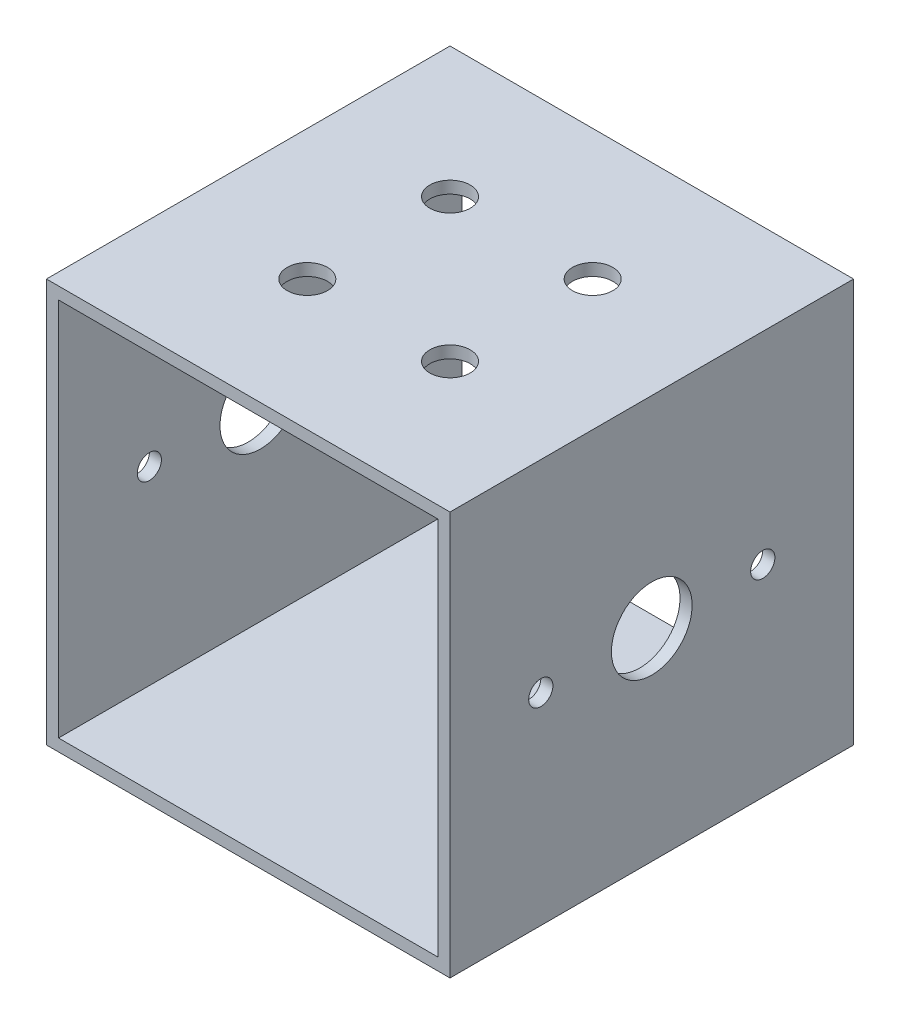
ISO-10303-21;
HEADER;
FILE_DESCRIPTION(('STEP AP214'),'2;1');
FILE_NAME('part.step','',(''),(''),'','','');
FILE_SCHEMA(('AUTOMOTIVE_DESIGN { 1 0 10303 214 1 1 1 1 }'));
ENDSEC;
DATA;
#1=APPLICATION_CONTEXT('core data for automotive mechanical design processes');
#2=APPLICATION_PROTOCOL_DEFINITION('international standard','automotive_design',2000,#1);
#3=PRODUCT_CONTEXT('',#1,'mechanical');
#4=PRODUCT('Part','Part','',(#3));
#5=PRODUCT_RELATED_PRODUCT_CATEGORY('part','',(#4));
#6=PRODUCT_DEFINITION_FORMATION('','',#4);
#7=PRODUCT_DEFINITION_CONTEXT('part definition',#1,'design');
#8=PRODUCT_DEFINITION('design','',#6,#7);
#9=PRODUCT_DEFINITION_SHAPE('','',#8);
#10=(LENGTH_UNIT() NAMED_UNIT(*) SI_UNIT(.MILLI.,.METRE.));
#11=(NAMED_UNIT(*) PLANE_ANGLE_UNIT() SI_UNIT($,.RADIAN.));
#12=(NAMED_UNIT(*) SI_UNIT($,.STERADIAN.) SOLID_ANGLE_UNIT());
#13=UNCERTAINTY_MEASURE_WITH_UNIT(LENGTH_MEASURE(1.E-05),#10,'distance_accuracy_value','');
#14=(GEOMETRIC_REPRESENTATION_CONTEXT(3) GLOBAL_UNCERTAINTY_ASSIGNED_CONTEXT((#13)) GLOBAL_UNIT_ASSIGNED_CONTEXT((#10,
#11,#12)) REPRESENTATION_CONTEXT('',''));
#15=CARTESIAN_POINT('',(0.,0.,0.));
#16=DIRECTION('',(0.,0.,1.));
#17=DIRECTION('',(1.,0.,0.));
#18=AXIS2_PLACEMENT_3D('',#15,#16,#17);
#19=CARTESIAN_POINT('',(25.,25.,50.));
#20=DIRECTION('',(0.,-1.,0.));
#21=DIRECTION('',(1.,0.,0.));
#22=AXIS2_PLACEMENT_3D('',#19,#20,#21);
#23=PLANE('',#22);
#24=CARTESIAN_POINT('',(-8.83883476483184,25.,33.8388347648319));
#25=DIRECTION('',(0.,1.,0.));
#26=DIRECTION('',(-1.,0.,0.));
#27=AXIS2_PLACEMENT_3D('',#24,#25,#26);
#28=CIRCLE('',#27,2.5);
#29=CARTESIAN_POINT('',(-11.3388347648318,25.,33.8388347648319));
#30=VERTEX_POINT('',#29);
#31=EDGE_CURVE('E252',#30,#30,#28,.T.);
#32=ORIENTED_EDGE('',*,*,#31,.F.);
#33=EDGE_LOOP('',(#32));
#34=FACE_BOUND('',#33,.T.);
#35=CARTESIAN_POINT('',(8.83883476483182,25.,33.8388347648319));
#36=DIRECTION('',(0.,1.,0.));
#37=DIRECTION('',(-1.,0.,0.));
#38=AXIS2_PLACEMENT_3D('',#35,#36,#37);
#39=CIRCLE('',#38,2.5);
#40=CARTESIAN_POINT('',(6.33883476483182,25.,33.8388347648319));
#41=VERTEX_POINT('',#40);
#42=EDGE_CURVE('E248',#41,#41,#39,.F.);
#43=ORIENTED_EDGE('',*,*,#42,.T.);
#44=EDGE_LOOP('',(#43));
#45=FACE_BOUND('',#44,.T.);
#46=CARTESIAN_POINT('',(-8.83883476483184,25.,16.1611652351681));
#47=DIRECTION('',(0.,1.,0.));
#48=DIRECTION('',(-1.,0.,0.));
#49=AXIS2_PLACEMENT_3D('',#46,#47,#48);
#50=CIRCLE('',#49,2.5);
#51=CARTESIAN_POINT('',(-11.3388347648318,25.,16.1611652351681));
#52=VERTEX_POINT('',#51);
#53=EDGE_CURVE('E205',#52,#52,#50,.F.);
#54=ORIENTED_EDGE('',*,*,#53,.T.);
#55=EDGE_LOOP('',(#54));
#56=FACE_BOUND('',#55,.T.);
#57=DIRECTION('',(-1.,0.,0.));
#58=VECTOR('',#57,1.);
#59=CARTESIAN_POINT('',(25.,25.,0.));
#60=LINE('',#59,#58);
#61=CARTESIAN_POINT('',(25.,25.,0.));
#62=VERTEX_POINT('',#61);
#63=CARTESIAN_POINT('',(-25.,25.,0.));
#64=VERTEX_POINT('',#63);
#65=EDGE_CURVE('E179',#62,#64,#60,.T.);
#66=ORIENTED_EDGE('',*,*,#65,.T.);
#67=DIRECTION('',(0.,0.,-1.));
#68=VECTOR('',#67,1.);
#69=CARTESIAN_POINT('',(-25.,25.,50.));
#70=LINE('',#69,#68);
#71=CARTESIAN_POINT('',(-25.,25.,50.));
#72=VERTEX_POINT('',#71);
#73=EDGE_CURVE('E187',#72,#64,#70,.T.);
#74=ORIENTED_EDGE('',*,*,#73,.F.);
#75=DIRECTION('',(-1.,0.,0.));
#76=VECTOR('',#75,1.);
#77=CARTESIAN_POINT('',(25.,25.,50.));
#78=LINE('',#77,#76);
#79=CARTESIAN_POINT('',(25.,25.,50.));
#80=VERTEX_POINT('',#79);
#81=EDGE_CURVE('E166',#80,#72,#78,.T.);
#82=ORIENTED_EDGE('',*,*,#81,.F.);
#83=DIRECTION('',(0.,0.,-1.));
#84=VECTOR('',#83,1.);
#85=CARTESIAN_POINT('',(25.,25.,50.));
#86=LINE('',#85,#84);
#87=EDGE_CURVE('E49',#80,#62,#86,.T.);
#88=ORIENTED_EDGE('',*,*,#87,.T.);
#89=EDGE_LOOP('',(#66,#74,#82,#88));
#90=FACE_BOUND('',#89,.T.);
#91=CARTESIAN_POINT('',(8.83883476483182,25.,16.1611652351681));
#92=DIRECTION('',(0.,1.,0.));
#93=DIRECTION('',(-1.,0.,0.));
#94=AXIS2_PLACEMENT_3D('',#91,#92,#93);
#95=CIRCLE('',#94,2.5);
#96=CARTESIAN_POINT('',(6.33883476483182,25.,16.1611652351681));
#97=VERTEX_POINT('',#96);
#98=EDGE_CURVE('E253',#97,#97,#95,.T.);
#99=ORIENTED_EDGE('',*,*,#98,.F.);
#100=EDGE_LOOP('',(#99));
#101=FACE_BOUND('',#100,.T.);
#102=ADVANCED_FACE('F39',(#34,#45,#56,#90,#101),#23,.F.);
#103=CARTESIAN_POINT('',(23.5,23.5,50.));
#104=DIRECTION('',(0.,-1.,0.));
#105=DIRECTION('',(1.,0.,0.));
#106=AXIS2_PLACEMENT_3D('',#103,#104,#105);
#107=PLANE('',#106);
#108=CARTESIAN_POINT('',(8.83883476483182,23.5,33.8388347648319));
#109=DIRECTION('',(0.,-1.,0.));
#110=DIRECTION('',(1.,0.,0.));
#111=AXIS2_PLACEMENT_3D('',#108,#109,#110);
#112=CIRCLE('',#111,2.5);
#113=CARTESIAN_POINT('',(11.3388347648318,23.5,33.8388347648319));
#114=VERTEX_POINT('',#113);
#115=EDGE_CURVE('E204',#114,#114,#112,.F.);
#116=ORIENTED_EDGE('',*,*,#115,.T.);
#117=EDGE_LOOP('',(#116));
#118=FACE_BOUND('',#117,.T.);
#119=CARTESIAN_POINT('',(-8.83883476483184,23.5,16.1611652351681));
#120=DIRECTION('',(0.,-1.,0.));
#121=DIRECTION('',(1.,0.,0.));
#122=AXIS2_PLACEMENT_3D('',#119,#120,#121);
#123=CIRCLE('',#122,2.5);
#124=CARTESIAN_POINT('',(-6.33883476483184,23.5,16.1611652351681));
#125=VERTEX_POINT('',#124);
#126=EDGE_CURVE('E200',#125,#125,#123,.F.);
#127=ORIENTED_EDGE('',*,*,#126,.T.);
#128=EDGE_LOOP('',(#127));
#129=FACE_BOUND('',#128,.T.);
#130=DIRECTION('',(-1.,0.,0.));
#131=VECTOR('',#130,1.);
#132=CARTESIAN_POINT('',(23.5,23.5,0.));
#133=LINE('',#132,#131);
#134=CARTESIAN_POINT('',(23.5,23.5,0.));
#135=VERTEX_POINT('',#134);
#136=CARTESIAN_POINT('',(-23.5,23.5,0.));
#137=VERTEX_POINT('',#136);
#138=EDGE_CURVE('E117',#135,#137,#133,.T.);
#139=ORIENTED_EDGE('',*,*,#138,.F.);
#140=DIRECTION('',(0.,0.,-1.));
#141=VECTOR('',#140,1.);
#142=CARTESIAN_POINT('',(23.5,23.5,50.));
#143=LINE('',#142,#141);
#144=CARTESIAN_POINT('',(23.5,23.5,50.));
#145=VERTEX_POINT('',#144);
#146=EDGE_CURVE('E57',#145,#135,#143,.T.);
#147=ORIENTED_EDGE('',*,*,#146,.F.);
#148=DIRECTION('',(-1.,0.,0.));
#149=VECTOR('',#148,1.);
#150=CARTESIAN_POINT('',(23.5,23.5,50.));
#151=LINE('',#150,#149);
#152=CARTESIAN_POINT('',(-23.5,23.5,50.));
#153=VERTEX_POINT('',#152);
#154=EDGE_CURVE('E134',#145,#153,#151,.T.);
#155=ORIENTED_EDGE('',*,*,#154,.T.);
#156=DIRECTION('',(0.,0.,-1.));
#157=VECTOR('',#156,1.);
#158=CARTESIAN_POINT('',(-23.5,23.5,50.));
#159=LINE('',#158,#157);
#160=EDGE_CURVE('E111',#153,#137,#159,.T.);
#161=ORIENTED_EDGE('',*,*,#160,.T.);
#162=EDGE_LOOP('',(#139,#147,#155,#161));
#163=FACE_BOUND('',#162,.T.);
#164=CARTESIAN_POINT('',(-8.83883476483184,23.5,33.8388347648319));
#165=DIRECTION('',(0.,-1.,0.));
#166=DIRECTION('',(1.,0.,0.));
#167=AXIS2_PLACEMENT_3D('',#164,#165,#166);
#168=CIRCLE('',#167,2.5);
#169=CARTESIAN_POINT('',(-6.33883476483184,23.5,33.8388347648319));
#170=VERTEX_POINT('',#169);
#171=EDGE_CURVE('E209',#170,#170,#168,.T.);
#172=ORIENTED_EDGE('',*,*,#171,.F.);
#173=EDGE_LOOP('',(#172));
#174=FACE_BOUND('',#173,.T.);
#175=CARTESIAN_POINT('',(8.83883476483182,23.5,16.1611652351681));
#176=DIRECTION('',(0.,-1.,0.));
#177=DIRECTION('',(1.,0.,0.));
#178=AXIS2_PLACEMENT_3D('',#175,#176,#177);
#179=CIRCLE('',#178,2.5);
#180=CARTESIAN_POINT('',(11.3388347648318,23.5,16.1611652351681));
#181=VERTEX_POINT('',#180);
#182=EDGE_CURVE('E213',#181,#181,#179,.T.);
#183=ORIENTED_EDGE('',*,*,#182,.F.);
#184=EDGE_LOOP('',(#183));
#185=FACE_BOUND('',#184,.T.);
#186=ADVANCED_FACE('F292',(#118,#129,#163,#174,#185),#107,.T.);
#187=CARTESIAN_POINT('',(0.,0.,50.));
#188=DIRECTION('',(0.,0.,-1.));
#189=DIRECTION('',(-1.,0.,0.));
#190=AXIS2_PLACEMENT_3D('',#187,#188,#189);
#191=PLANE('',#190);
#192=DIRECTION('',(1.,0.,0.));
#193=VECTOR('',#192,1.);
#194=CARTESIAN_POINT('',(25.,-25.,50.));
#195=LINE('',#194,#193);
#196=CARTESIAN_POINT('',(-25.,-25.,50.));
#197=VERTEX_POINT('',#196);
#198=CARTESIAN_POINT('',(25.,-25.,50.));
#199=VERTEX_POINT('',#198);
#200=EDGE_CURVE('E158',#197,#199,#195,.T.);
#201=ORIENTED_EDGE('',*,*,#200,.T.);
#202=DIRECTION('',(0.,1.,0.));
#203=VECTOR('',#202,1.);
#204=CARTESIAN_POINT('',(25.,-25.,50.));
#205=LINE('',#204,#203);
#206=EDGE_CURVE('E162',#199,#80,#205,.T.);
#207=ORIENTED_EDGE('',*,*,#206,.T.);
#208=ORIENTED_EDGE('',*,*,#81,.T.);
#209=DIRECTION('',(0.,-1.,0.));
#210=VECTOR('',#209,1.);
#211=CARTESIAN_POINT('',(-25.,-25.,50.));
#212=LINE('',#211,#210);
#213=EDGE_CURVE('E169',#72,#197,#212,.T.);
#214=ORIENTED_EDGE('',*,*,#213,.T.);
#215=EDGE_LOOP('',(#201,#207,#208,#214));
#216=FACE_BOUND('',#215,.T.);
#217=DIRECTION('',(0.,-1.,0.));
#218=VECTOR('',#217,1.);
#219=CARTESIAN_POINT('',(-23.5,-23.5,50.));
#220=LINE('',#219,#218);
#221=CARTESIAN_POINT('',(-23.5,-23.5,50.));
#222=VERTEX_POINT('',#221);
#223=EDGE_CURVE('E107',#153,#222,#220,.T.);
#224=ORIENTED_EDGE('',*,*,#223,.F.);
#225=ORIENTED_EDGE('',*,*,#154,.F.);
#226=DIRECTION('',(0.,1.,0.));
#227=VECTOR('',#226,1.);
#228=CARTESIAN_POINT('',(23.5,-23.5,50.));
#229=LINE('',#228,#227);
#230=CARTESIAN_POINT('',(23.5,-23.5,50.));
#231=VERTEX_POINT('',#230);
#232=EDGE_CURVE('E130',#231,#145,#229,.T.);
#233=ORIENTED_EDGE('',*,*,#232,.F.);
#234=DIRECTION('',(1.,0.,0.));
#235=VECTOR('',#234,1.);
#236=CARTESIAN_POINT('',(23.5,-23.5,50.));
#237=LINE('',#236,#235);
#238=EDGE_CURVE('E116',#222,#231,#237,.T.);
#239=ORIENTED_EDGE('',*,*,#238,.F.);
#240=EDGE_LOOP('',(#224,#225,#233,#239));
#241=FACE_BOUND('',#240,.T.);
#242=ADVANCED_FACE('F129',(#216,#241),#191,.F.);
#243=CARTESIAN_POINT('',(0.,0.,0.));
#244=DIRECTION('',(0.,0.,-1.));
#245=DIRECTION('',(-1.,0.,0.));
#246=AXIS2_PLACEMENT_3D('',#243,#244,#245);
#247=PLANE('',#246);
#248=DIRECTION('',(1.,0.,0.));
#249=VECTOR('',#248,1.);
#250=CARTESIAN_POINT('',(25.,-25.,0.));
#251=LINE('',#250,#249);
#252=CARTESIAN_POINT('',(-25.,-25.,0.));
#253=VERTEX_POINT('',#252);
#254=CARTESIAN_POINT('',(25.,-25.,0.));
#255=VERTEX_POINT('',#254);
#256=EDGE_CURVE('E125',#253,#255,#251,.T.);
#257=ORIENTED_EDGE('',*,*,#256,.F.);
#258=DIRECTION('',(0.,-1.,0.));
#259=VECTOR('',#258,1.);
#260=CARTESIAN_POINT('',(-25.,-25.,0.));
#261=LINE('',#260,#259);
#262=EDGE_CURVE('E163',#64,#253,#261,.T.);
#263=ORIENTED_EDGE('',*,*,#262,.F.);
#264=ORIENTED_EDGE('',*,*,#65,.F.);
#265=DIRECTION('',(0.,1.,0.));
#266=VECTOR('',#265,1.);
#267=CARTESIAN_POINT('',(25.,-25.,0.));
#268=LINE('',#267,#266);
#269=EDGE_CURVE('E176',#255,#62,#268,.T.);
#270=ORIENTED_EDGE('',*,*,#269,.F.);
#271=EDGE_LOOP('',(#257,#263,#264,#270));
#272=FACE_BOUND('',#271,.T.);
#273=ORIENTED_EDGE('',*,*,#138,.T.);
#274=DIRECTION('',(0.,-1.,0.));
#275=VECTOR('',#274,1.);
#276=CARTESIAN_POINT('',(-23.5,-23.5,0.));
#277=LINE('',#276,#275);
#278=CARTESIAN_POINT('',(-23.5,-23.5,0.));
#279=VERTEX_POINT('',#278);
#280=EDGE_CURVE('E65',#137,#279,#277,.T.);
#281=ORIENTED_EDGE('',*,*,#280,.T.);
#282=DIRECTION('',(1.,0.,0.));
#283=VECTOR('',#282,1.);
#284=CARTESIAN_POINT('',(23.5,-23.5,0.));
#285=LINE('',#284,#283);
#286=CARTESIAN_POINT('',(23.5,-23.5,0.));
#287=VERTEX_POINT('',#286);
#288=EDGE_CURVE('E123',#279,#287,#285,.T.);
#289=ORIENTED_EDGE('',*,*,#288,.T.);
#290=DIRECTION('',(0.,1.,0.));
#291=VECTOR('',#290,1.);
#292=CARTESIAN_POINT('',(23.5,-23.5,0.));
#293=LINE('',#292,#291);
#294=EDGE_CURVE('E145',#287,#135,#293,.T.);
#295=ORIENTED_EDGE('',*,*,#294,.T.);
#296=EDGE_LOOP('',(#273,#281,#289,#295));
#297=FACE_BOUND('',#296,.T.);
#298=ADVANCED_FACE('F310',(#272,#297),#247,.T.);
#299=CARTESIAN_POINT('',(25.,-25.,50.));
#300=DIRECTION('',(0.,1.,0.));
#301=DIRECTION('',(-1.,0.,0.));
#302=AXIS2_PLACEMENT_3D('',#299,#300,#301);
#303=PLANE('',#302);
#304=ORIENTED_EDGE('',*,*,#256,.T.);
#305=DIRECTION('',(0.,0.,-1.));
#306=VECTOR('',#305,1.);
#307=CARTESIAN_POINT('',(25.,-25.,50.));
#308=LINE('',#307,#306);
#309=EDGE_CURVE('E11',#199,#255,#308,.T.);
#310=ORIENTED_EDGE('',*,*,#309,.F.);
#311=ORIENTED_EDGE('',*,*,#200,.F.);
#312=DIRECTION('',(0.,0.,-1.));
#313=VECTOR('',#312,1.);
#314=CARTESIAN_POINT('',(-25.,-25.,50.));
#315=LINE('',#314,#313);
#316=EDGE_CURVE('E172',#197,#253,#315,.T.);
#317=ORIENTED_EDGE('',*,*,#316,.T.);
#318=EDGE_LOOP('',(#304,#310,#311,#317));
#319=FACE_BOUND('',#318,.T.);
#320=ADVANCED_FACE('F41',(#319),#303,.F.);
#321=CARTESIAN_POINT('',(25.,-25.,50.));
#322=DIRECTION('',(-1.,0.,0.));
#323=DIRECTION('',(0.,0.,1.));
#324=AXIS2_PLACEMENT_3D('',#321,#322,#323);
#325=PLANE('',#324);
#326=CARTESIAN_POINT('',(25.,1.08190815303128E-13,11.25));
#327=DIRECTION('',(-1.,0.,0.));
#328=DIRECTION('',(0.,0.,1.));
#329=AXIS2_PLACEMENT_3D('',#326,#327,#328);
#330=CIRCLE('',#329,1.5);
#331=CARTESIAN_POINT('',(25.,1.08190815303128E-13,12.75));
#332=VERTEX_POINT('',#331);
#333=EDGE_CURVE('E244',#332,#332,#330,.T.);
#334=ORIENTED_EDGE('',*,*,#333,.T.);
#335=EDGE_LOOP('',(#334));
#336=FACE_BOUND('',#335,.T.);
#337=CARTESIAN_POINT('',(25.,0.,38.75));
#338=DIRECTION('',(-1.,0.,0.));
#339=DIRECTION('',(0.,0.,1.));
#340=AXIS2_PLACEMENT_3D('',#337,#338,#339);
#341=CIRCLE('',#340,1.5);
#342=CARTESIAN_POINT('',(25.,0.,40.25));
#343=VERTEX_POINT('',#342);
#344=EDGE_CURVE('E226',#343,#343,#341,.T.);
#345=ORIENTED_EDGE('',*,*,#344,.T.);
#346=EDGE_LOOP('',(#345));
#347=FACE_BOUND('',#346,.T.);
#348=CARTESIAN_POINT('',(25.,0.,25.));
#349=DIRECTION('',(-1.,0.,0.));
#350=DIRECTION('',(0.,0.,1.));
#351=AXIS2_PLACEMENT_3D('',#348,#349,#350);
#352=CIRCLE('',#351,5.);
#353=CARTESIAN_POINT('',(25.,0.,30.));
#354=VERTEX_POINT('',#353);
#355=EDGE_CURVE('E142',#354,#354,#352,.T.);
#356=ORIENTED_EDGE('',*,*,#355,.T.);
#357=EDGE_LOOP('',(#356));
#358=FACE_BOUND('',#357,.T.);
#359=ORIENTED_EDGE('',*,*,#269,.T.);
#360=ORIENTED_EDGE('',*,*,#87,.F.);
#361=ORIENTED_EDGE('',*,*,#206,.F.);
#362=ORIENTED_EDGE('',*,*,#309,.T.);
#363=EDGE_LOOP('',(#359,#360,#361,#362));
#364=FACE_BOUND('',#363,.T.);
#365=ADVANCED_FACE('F272',(#336,#347,#358,#364),#325,.F.);
#366=CARTESIAN_POINT('',(-25.,-25.,50.));
#367=DIRECTION('',(1.,0.,0.));
#368=DIRECTION('',(0.,0.,-1.));
#369=AXIS2_PLACEMENT_3D('',#366,#367,#368);
#370=PLANE('',#369);
#371=CARTESIAN_POINT('',(-25.,1.08190815303128E-13,11.25));
#372=DIRECTION('',(1.,0.,0.));
#373=DIRECTION('',(0.,0.,-1.));
#374=AXIS2_PLACEMENT_3D('',#371,#372,#373);
#375=CIRCLE('',#374,1.5);
#376=CARTESIAN_POINT('',(-25.,1.08190815303128E-13,9.75000000000002));
#377=VERTEX_POINT('',#376);
#378=EDGE_CURVE('E220',#377,#377,#375,.T.);
#379=ORIENTED_EDGE('',*,*,#378,.T.);
#380=EDGE_LOOP('',(#379));
#381=FACE_BOUND('',#380,.T.);
#382=CARTESIAN_POINT('',(-25.,0.,38.75));
#383=DIRECTION('',(1.,0.,0.));
#384=DIRECTION('',(0.,0.,-1.));
#385=AXIS2_PLACEMENT_3D('',#382,#383,#384);
#386=CIRCLE('',#385,1.5);
#387=CARTESIAN_POINT('',(-25.,0.,37.25));
#388=VERTEX_POINT('',#387);
#389=EDGE_CURVE('E229',#388,#388,#386,.T.);
#390=ORIENTED_EDGE('',*,*,#389,.T.);
#391=EDGE_LOOP('',(#390));
#392=FACE_BOUND('',#391,.T.);
#393=CARTESIAN_POINT('',(-25.,0.,25.));
#394=DIRECTION('',(1.,0.,0.));
#395=DIRECTION('',(0.,0.,-1.));
#396=AXIS2_PLACEMENT_3D('',#393,#394,#395);
#397=CIRCLE('',#396,5.);
#398=CARTESIAN_POINT('',(-25.,0.,20.));
#399=VERTEX_POINT('',#398);
#400=EDGE_CURVE('E199',#399,#399,#397,.T.);
#401=ORIENTED_EDGE('',*,*,#400,.T.);
#402=EDGE_LOOP('',(#401));
#403=FACE_BOUND('',#402,.T.);
#404=ORIENTED_EDGE('',*,*,#262,.T.);
#405=ORIENTED_EDGE('',*,*,#316,.F.);
#406=ORIENTED_EDGE('',*,*,#213,.F.);
#407=ORIENTED_EDGE('',*,*,#73,.T.);
#408=EDGE_LOOP('',(#404,#405,#406,#407));
#409=FACE_BOUND('',#408,.T.);
#410=ADVANCED_FACE('F302',(#381,#392,#403,#409),#370,.F.);
#411=CARTESIAN_POINT('',(-23.5,-23.5,50.));
#412=DIRECTION('',(1.,0.,0.));
#413=DIRECTION('',(0.,0.,-1.));
#414=AXIS2_PLACEMENT_3D('',#411,#412,#413);
#415=PLANE('',#414);
#416=CARTESIAN_POINT('',(-23.5,1.08190815303128E-13,11.25));
#417=DIRECTION('',(1.,0.,0.));
#418=DIRECTION('',(0.,0.,-1.));
#419=AXIS2_PLACEMENT_3D('',#416,#417,#418);
#420=CIRCLE('',#419,1.5);
#421=CARTESIAN_POINT('',(-23.5,1.08190815303128E-13,9.75000000000002));
#422=VERTEX_POINT('',#421);
#423=EDGE_CURVE('E240',#422,#422,#420,.T.);
#424=ORIENTED_EDGE('',*,*,#423,.F.);
#425=EDGE_LOOP('',(#424));
#426=FACE_BOUND('',#425,.T.);
#427=CARTESIAN_POINT('',(-23.5,0.,38.75));
#428=DIRECTION('',(1.,0.,0.));
#429=DIRECTION('',(0.,0.,-1.));
#430=AXIS2_PLACEMENT_3D('',#427,#428,#429);
#431=CIRCLE('',#430,1.5);
#432=CARTESIAN_POINT('',(-23.5,0.,37.25));
#433=VERTEX_POINT('',#432);
#434=EDGE_CURVE('E219',#433,#433,#431,.T.);
#435=ORIENTED_EDGE('',*,*,#434,.F.);
#436=EDGE_LOOP('',(#435));
#437=FACE_BOUND('',#436,.T.);
#438=CARTESIAN_POINT('',(-23.5,0.,25.));
#439=DIRECTION('',(1.,0.,0.));
#440=DIRECTION('',(0.,0.,-1.));
#441=AXIS2_PLACEMENT_3D('',#438,#439,#440);
#442=CIRCLE('',#441,5.);
#443=CARTESIAN_POINT('',(-23.5,0.,20.));
#444=VERTEX_POINT('',#443);
#445=EDGE_CURVE('E198',#444,#444,#442,.T.);
#446=ORIENTED_EDGE('',*,*,#445,.F.);
#447=EDGE_LOOP('',(#446));
#448=FACE_BOUND('',#447,.T.);
#449=ORIENTED_EDGE('',*,*,#280,.F.);
#450=ORIENTED_EDGE('',*,*,#160,.F.);
#451=ORIENTED_EDGE('',*,*,#223,.T.);
#452=DIRECTION('',(0.,0.,-1.));
#453=VECTOR('',#452,1.);
#454=CARTESIAN_POINT('',(-23.5,-23.5,50.));
#455=LINE('',#454,#453);
#456=EDGE_CURVE('E110',#222,#279,#455,.T.);
#457=ORIENTED_EDGE('',*,*,#456,.T.);
#458=EDGE_LOOP('',(#449,#450,#451,#457));
#459=FACE_BOUND('',#458,.T.);
#460=ADVANCED_FACE('F109',(#426,#437,#448,#459),#415,.T.);
#461=CARTESIAN_POINT('',(23.5,-23.5,50.));
#462=DIRECTION('',(0.,1.,0.));
#463=DIRECTION('',(-1.,0.,0.));
#464=AXIS2_PLACEMENT_3D('',#461,#462,#463);
#465=PLANE('',#464);
#466=ORIENTED_EDGE('',*,*,#288,.F.);
#467=ORIENTED_EDGE('',*,*,#456,.F.);
#468=ORIENTED_EDGE('',*,*,#238,.T.);
#469=DIRECTION('',(0.,0.,-1.));
#470=VECTOR('',#469,1.);
#471=CARTESIAN_POINT('',(23.5,-23.5,50.));
#472=LINE('',#471,#470);
#473=EDGE_CURVE('E126',#231,#287,#472,.T.);
#474=ORIENTED_EDGE('',*,*,#473,.T.);
#475=EDGE_LOOP('',(#466,#467,#468,#474));
#476=FACE_BOUND('',#475,.T.);
#477=ADVANCED_FACE('F120',(#476),#465,.T.);
#478=CARTESIAN_POINT('',(23.5,-23.5,50.));
#479=DIRECTION('',(-1.,0.,0.));
#480=DIRECTION('',(0.,0.,1.));
#481=AXIS2_PLACEMENT_3D('',#478,#479,#480);
#482=PLANE('',#481);
#483=CARTESIAN_POINT('',(23.5,1.08190815303128E-13,11.25));
#484=DIRECTION('',(-1.,0.,0.));
#485=DIRECTION('',(0.,0.,1.));
#486=AXIS2_PLACEMENT_3D('',#483,#484,#485);
#487=CIRCLE('',#486,1.5);
#488=CARTESIAN_POINT('',(23.5,1.08190815303128E-13,12.75));
#489=VERTEX_POINT('',#488);
#490=EDGE_CURVE('E43',#489,#489,#487,.T.);
#491=ORIENTED_EDGE('',*,*,#490,.F.);
#492=EDGE_LOOP('',(#491));
#493=FACE_BOUND('',#492,.T.);
#494=CARTESIAN_POINT('',(23.5,0.,38.75));
#495=DIRECTION('',(-1.,0.,0.));
#496=DIRECTION('',(0.,0.,1.));
#497=AXIS2_PLACEMENT_3D('',#494,#495,#496);
#498=CIRCLE('',#497,1.5);
#499=CARTESIAN_POINT('',(23.5,0.,40.25));
#500=VERTEX_POINT('',#499);
#501=EDGE_CURVE('E216',#500,#500,#498,.T.);
#502=ORIENTED_EDGE('',*,*,#501,.F.);
#503=EDGE_LOOP('',(#502));
#504=FACE_BOUND('',#503,.T.);
#505=CARTESIAN_POINT('',(23.5,0.,25.));
#506=DIRECTION('',(-1.,0.,0.));
#507=DIRECTION('',(0.,0.,1.));
#508=AXIS2_PLACEMENT_3D('',#505,#506,#507);
#509=CIRCLE('',#508,5.);
#510=CARTESIAN_POINT('',(23.5,0.,30.));
#511=VERTEX_POINT('',#510);
#512=EDGE_CURVE('E194',#511,#511,#509,.T.);
#513=ORIENTED_EDGE('',*,*,#512,.F.);
#514=EDGE_LOOP('',(#513));
#515=FACE_BOUND('',#514,.T.);
#516=ORIENTED_EDGE('',*,*,#294,.F.);
#517=ORIENTED_EDGE('',*,*,#473,.F.);
#518=ORIENTED_EDGE('',*,*,#232,.T.);
#519=ORIENTED_EDGE('',*,*,#146,.T.);
#520=EDGE_LOOP('',(#516,#517,#518,#519));
#521=FACE_BOUND('',#520,.T.);
#522=ADVANCED_FACE('F278',(#493,#504,#515,#521),#482,.T.);
#523=CARTESIAN_POINT('',(-25.,0.,25.));
#524=DIRECTION('',(1.,0.,0.));
#525=DIRECTION('',(0.,0.,-1.));
#526=AXIS2_PLACEMENT_3D('',#523,#524,#525);
#527=CYLINDRICAL_SURFACE('',#526,5.);
#528=ORIENTED_EDGE('',*,*,#512,.T.);
#529=EDGE_LOOP('',(#528));
#530=FACE_BOUND('',#529,.T.);
#531=ORIENTED_EDGE('',*,*,#355,.F.);
#532=EDGE_LOOP('',(#531));
#533=FACE_BOUND('',#532,.T.);
#534=ADVANCED_FACE('F275',(#530,#533),#527,.F.);
#535=ORIENTED_EDGE('',*,*,#445,.T.);
#536=EDGE_LOOP('',(#535));
#537=FACE_BOUND('',#536,.T.);
#538=ORIENTED_EDGE('',*,*,#400,.F.);
#539=EDGE_LOOP('',(#538));
#540=FACE_BOUND('',#539,.T.);
#541=ADVANCED_FACE('F277',(#537,#540),#527,.F.);
#542=CARTESIAN_POINT('',(-8.83883476483184,15.,16.1611652351681));
#543=DIRECTION('',(0.,1.,0.));
#544=DIRECTION('',(-1.,0.,0.));
#545=AXIS2_PLACEMENT_3D('',#542,#543,#544);
#546=CYLINDRICAL_SURFACE('',#545,2.5);
#547=ORIENTED_EDGE('',*,*,#126,.F.);
#548=EDGE_LOOP('',(#547));
#549=FACE_BOUND('',#548,.T.);
#550=ORIENTED_EDGE('',*,*,#53,.F.);
#551=EDGE_LOOP('',(#550));
#552=FACE_BOUND('',#551,.T.);
#553=ADVANCED_FACE('F285',(#549,#552),#546,.F.);
#554=CARTESIAN_POINT('',(8.83883476483182,15.,33.8388347648319));
#555=DIRECTION('',(0.,1.,0.));
#556=DIRECTION('',(-1.,0.,0.));
#557=AXIS2_PLACEMENT_3D('',#554,#555,#556);
#558=CYLINDRICAL_SURFACE('',#557,2.5);
#559=ORIENTED_EDGE('',*,*,#115,.F.);
#560=EDGE_LOOP('',(#559));
#561=FACE_BOUND('',#560,.T.);
#562=ORIENTED_EDGE('',*,*,#42,.F.);
#563=EDGE_LOOP('',(#562));
#564=FACE_BOUND('',#563,.T.);
#565=ADVANCED_FACE('F421',(#561,#564),#558,.F.);
#566=CARTESIAN_POINT('',(-8.83883476483184,15.,33.8388347648319));
#567=DIRECTION('',(0.,1.,0.));
#568=DIRECTION('',(-1.,0.,0.));
#569=AXIS2_PLACEMENT_3D('',#566,#567,#568);
#570=CYLINDRICAL_SURFACE('',#569,2.5);
#571=ORIENTED_EDGE('',*,*,#171,.T.);
#572=EDGE_LOOP('',(#571));
#573=FACE_BOUND('',#572,.T.);
#574=ORIENTED_EDGE('',*,*,#31,.T.);
#575=EDGE_LOOP('',(#574));
#576=FACE_BOUND('',#575,.T.);
#577=ADVANCED_FACE('F329',(#573,#576),#570,.F.);
#578=CARTESIAN_POINT('',(8.83883476483182,15.,16.1611652351681));
#579=DIRECTION('',(0.,1.,0.));
#580=DIRECTION('',(-1.,0.,0.));
#581=AXIS2_PLACEMENT_3D('',#578,#579,#580);
#582=CYLINDRICAL_SURFACE('',#581,2.5);
#583=ORIENTED_EDGE('',*,*,#182,.T.);
#584=EDGE_LOOP('',(#583));
#585=FACE_BOUND('',#584,.T.);
#586=ORIENTED_EDGE('',*,*,#98,.T.);
#587=EDGE_LOOP('',(#586));
#588=FACE_BOUND('',#587,.T.);
#589=ADVANCED_FACE('F319',(#585,#588),#582,.F.);
#590=CARTESIAN_POINT('',(-25.,0.,38.75));
#591=DIRECTION('',(1.,0.,0.));
#592=DIRECTION('',(0.,0.,-1.));
#593=AXIS2_PLACEMENT_3D('',#590,#591,#592);
#594=CYLINDRICAL_SURFACE('',#593,1.5);
#595=ORIENTED_EDGE('',*,*,#501,.T.);
#596=EDGE_LOOP('',(#595));
#597=FACE_BOUND('',#596,.T.);
#598=ORIENTED_EDGE('',*,*,#344,.F.);
#599=EDGE_LOOP('',(#598));
#600=FACE_BOUND('',#599,.T.);
#601=ADVANCED_FACE('F316',(#597,#600),#594,.F.);
#602=CARTESIAN_POINT('',(-25.,1.08190815303128E-13,11.25));
#603=DIRECTION('',(1.,0.,0.));
#604=DIRECTION('',(0.,0.,-1.));
#605=AXIS2_PLACEMENT_3D('',#602,#603,#604);
#606=CYLINDRICAL_SURFACE('',#605,1.5);
#607=ORIENTED_EDGE('',*,*,#490,.T.);
#608=EDGE_LOOP('',(#607));
#609=FACE_BOUND('',#608,.T.);
#610=ORIENTED_EDGE('',*,*,#333,.F.);
#611=EDGE_LOOP('',(#610));
#612=FACE_BOUND('',#611,.T.);
#613=ADVANCED_FACE('F318',(#609,#612),#606,.F.);
#614=ORIENTED_EDGE('',*,*,#434,.T.);
#615=EDGE_LOOP('',(#614));
#616=FACE_BOUND('',#615,.T.);
#617=ORIENTED_EDGE('',*,*,#389,.F.);
#618=EDGE_LOOP('',(#617));
#619=FACE_BOUND('',#618,.T.);
#620=ADVANCED_FACE('F321',(#616,#619),#594,.F.);
#621=ORIENTED_EDGE('',*,*,#423,.T.);
#622=EDGE_LOOP('',(#621));
#623=FACE_BOUND('',#622,.T.);
#624=ORIENTED_EDGE('',*,*,#378,.F.);
#625=EDGE_LOOP('',(#624));
#626=FACE_BOUND('',#625,.T.);
#627=ADVANCED_FACE('F328',(#623,#626),#606,.F.);
#628=CLOSED_SHELL('',(#102,#186,#242,#298,#320,#365,#410,#460,#477,#522,#534,#541,#553,#565,
#577,#589,#601,#613,#620,#627));
#629=MANIFOLD_SOLID_BREP('B2',#628);
#630=ADVANCED_BREP_SHAPE_REPRESENTATION('',(#18,#629),#14);
#631=SHAPE_DEFINITION_REPRESENTATION(#9,#630);
ENDSEC;
END-ISO-10303-21;
